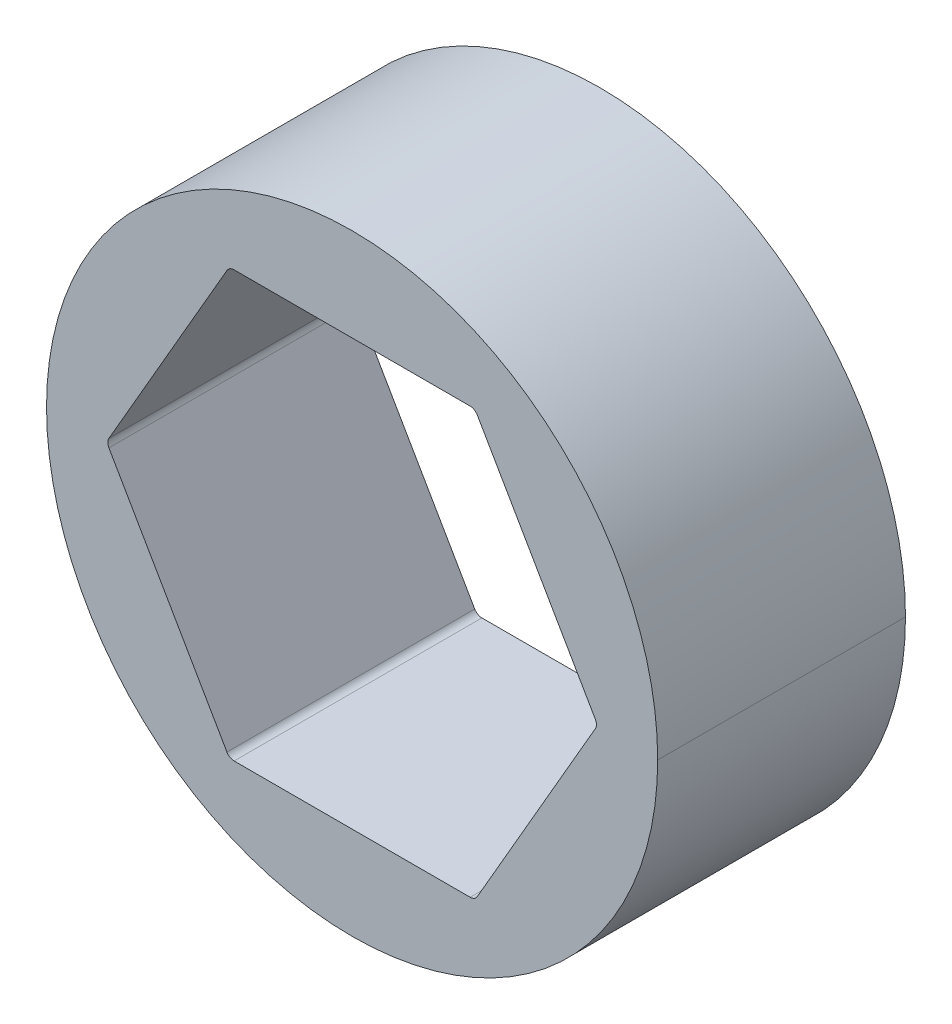
ISO-10303-21;
HEADER;
FILE_DESCRIPTION(('STEP AP214'),'2;1');
FILE_NAME('part.step','',(''),(''),'','','');
FILE_SCHEMA(('AUTOMOTIVE_DESIGN { 1 0 10303 214 1 1 1 1 }'));
ENDSEC;
DATA;
#1=APPLICATION_CONTEXT('core data for automotive mechanical design processes');
#2=APPLICATION_PROTOCOL_DEFINITION('international standard','automotive_design',2000,#1);
#3=PRODUCT_CONTEXT('',#1,'mechanical');
#4=PRODUCT('Part','Part','',(#3));
#5=PRODUCT_RELATED_PRODUCT_CATEGORY('part','',(#4));
#6=PRODUCT_DEFINITION_FORMATION('','',#4);
#7=PRODUCT_DEFINITION_CONTEXT('part definition',#1,'design');
#8=PRODUCT_DEFINITION('design','',#6,#7);
#9=PRODUCT_DEFINITION_SHAPE('','',#8);
#10=(LENGTH_UNIT() NAMED_UNIT(*) SI_UNIT(.MILLI.,.METRE.));
#11=(NAMED_UNIT(*) PLANE_ANGLE_UNIT() SI_UNIT($,.RADIAN.));
#12=(NAMED_UNIT(*) SI_UNIT($,.STERADIAN.) SOLID_ANGLE_UNIT());
#13=UNCERTAINTY_MEASURE_WITH_UNIT(LENGTH_MEASURE(1.E-05),#10,'distance_accuracy_value','');
#14=(GEOMETRIC_REPRESENTATION_CONTEXT(3) GLOBAL_UNCERTAINTY_ASSIGNED_CONTEXT((#13)) GLOBAL_UNIT_ASSIGNED_CONTEXT((#10,
#11,#12)) REPRESENTATION_CONTEXT('',''));
#15=CARTESIAN_POINT('',(0.,0.,0.));
#16=DIRECTION('',(0.,0.,1.));
#17=DIRECTION('',(1.,0.,0.));
#18=AXIS2_PLACEMENT_3D('',#15,#16,#17);
#19=CARTESIAN_POINT('',(7.25902493452117,0.,30.48));
#20=DIRECTION('',(0.,0.,1.));
#21=DIRECTION('',(1.,0.,0.));
#22=AXIS2_PLACEMENT_3D('',#19,#20,#21);
#23=CYLINDRICAL_SURFACE('',#22,0.254);
#24=CARTESIAN_POINT('',(7.25902493452117,0.,7.62));
#25=DIRECTION('',(0.,0.,1.));
#26=DIRECTION('',(1.,0.,0.));
#27=AXIS2_PLACEMENT_3D('',#24,#25,#26);
#28=CIRCLE('',#27,0.254);
#29=CARTESIAN_POINT('',(7.47899538708242,0.127,7.62));
#30=VERTEX_POINT('',#29);
#31=CARTESIAN_POINT('',(7.51302493452117,0.,7.62));
#32=VERTEX_POINT('',#31);
#33=EDGE_CURVE('E305',#30,#32,#28,.F.);
#34=ORIENTED_EDGE('',*,*,#33,.F.);
#35=DIRECTION('',(0.,0.,1.));
#36=VECTOR('',#35,1.);
#37=CARTESIAN_POINT('',(7.47899538708242,0.127,30.48));
#38=LINE('',#37,#36);
#39=CARTESIAN_POINT('',(7.47899538708242,0.127,0.));
#40=VERTEX_POINT('',#39);
#41=EDGE_CURVE('E271',#40,#30,#38,.T.);
#42=ORIENTED_EDGE('',*,*,#41,.F.);
#43=CARTESIAN_POINT('',(7.25902493452117,0.,0.));
#44=DIRECTION('',(0.,0.,1.));
#45=DIRECTION('',(1.,0.,0.));
#46=AXIS2_PLACEMENT_3D('',#43,#44,#45);
#47=CIRCLE('',#46,0.254);
#48=CARTESIAN_POINT('',(7.51302493452117,0.,0.));
#49=VERTEX_POINT('',#48);
#50=EDGE_CURVE('E203',#49,#40,#47,.T.);
#51=ORIENTED_EDGE('',*,*,#50,.F.);
#52=DIRECTION('',(0.,0.,1.));
#53=VECTOR('',#52,1.);
#54=CARTESIAN_POINT('',(7.51302493452117,0.,30.48));
#55=LINE('',#54,#53);
#56=EDGE_CURVE('E56',#49,#32,#55,.T.);
#57=ORIENTED_EDGE('',*,*,#56,.T.);
#58=EDGE_LOOP('',(#34,#42,#51,#57));
#59=FACE_BOUND('',#58,.T.);
#60=ADVANCED_FACE('F47',(#59),#23,.F.);
#61=CARTESIAN_POINT('',(0.,0.,30.48));
#62=DIRECTION('',(0.,0.,-1.));
#63=DIRECTION('',(-1.,0.,0.));
#64=AXIS2_PLACEMENT_3D('',#61,#62,#63);
#65=CYLINDRICAL_SURFACE('',#64,9.398);
#66=DIRECTION('',(0.,0.,-1.));
#67=VECTOR('',#66,1.);
#68=CARTESIAN_POINT('',(-9.398,0.,30.48));
#69=LINE('',#68,#67);
#70=CARTESIAN_POINT('',(-9.398,0.,7.62));
#71=VERTEX_POINT('',#70);
#72=CARTESIAN_POINT('',(-9.398,0.,0.));
#73=VERTEX_POINT('',#72);
#74=EDGE_CURVE('E178',#71,#73,#69,.T.);
#75=ORIENTED_EDGE('',*,*,#74,.F.);
#76=CARTESIAN_POINT('',(0.,0.,7.62));
#77=DIRECTION('',(0.,0.,1.));
#78=DIRECTION('',(1.,0.,0.));
#79=AXIS2_PLACEMENT_3D('',#76,#77,#78);
#80=CIRCLE('',#79,9.398);
#81=CARTESIAN_POINT('',(9.398,0.,7.62));
#82=VERTEX_POINT('',#81);
#83=EDGE_CURVE('E62',#82,#71,#80,.T.);
#84=ORIENTED_EDGE('',*,*,#83,.F.);
#85=DIRECTION('',(0.,0.,-1.));
#86=VECTOR('',#85,1.);
#87=CARTESIAN_POINT('',(9.398,0.,30.48));
#88=LINE('',#87,#86);
#89=CARTESIAN_POINT('',(9.398,0.,0.));
#90=VERTEX_POINT('',#89);
#91=EDGE_CURVE('E176',#82,#90,#88,.T.);
#92=ORIENTED_EDGE('',*,*,#91,.T.);
#93=CARTESIAN_POINT('',(0.,0.,0.));
#94=DIRECTION('',(0.,0.,1.));
#95=DIRECTION('',(1.,0.,0.));
#96=AXIS2_PLACEMENT_3D('',#93,#94,#95);
#97=CIRCLE('',#96,9.398);
#98=EDGE_CURVE('E185',#90,#73,#97,.T.);
#99=ORIENTED_EDGE('',*,*,#98,.T.);
#100=EDGE_LOOP('',(#75,#84,#92,#99));
#101=FACE_BOUND('',#100,.T.);
#102=ADVANCED_FACE('F174',(#101),#65,.T.);
#103=CARTESIAN_POINT('',(0.,0.,30.48));
#104=DIRECTION('',(0.,0.,-1.));
#105=DIRECTION('',(-1.,0.,0.));
#106=AXIS2_PLACEMENT_3D('',#103,#104,#105);
#107=CYLINDRICAL_SURFACE('',#106,9.398);
#108=ORIENTED_EDGE('',*,*,#91,.F.);
#109=EDGE_CURVE('E166',#71,#82,#80,.T.);
#110=ORIENTED_EDGE('',*,*,#109,.F.);
#111=ORIENTED_EDGE('',*,*,#74,.T.);
#112=CARTESIAN_POINT('',(0.,0.,0.));
#113=DIRECTION('',(0.,0.,1.));
#114=DIRECTION('',(1.,0.,0.));
#115=AXIS2_PLACEMENT_3D('',#112,#113,#114);
#116=CIRCLE('',#115,9.398);
#117=EDGE_CURVE('E183',#73,#90,#116,.T.);
#118=ORIENTED_EDGE('',*,*,#117,.T.);
#119=EDGE_LOOP('',(#108,#110,#111,#118));
#120=FACE_BOUND('',#119,.T.);
#121=ADVANCED_FACE('F181',(#120),#107,.T.);
#122=CARTESIAN_POINT('',(3.77615943563475,-6.5405,30.48));
#123=DIRECTION('',(-0.866025403784439,0.5,0.));
#124=DIRECTION('',(0.,0.,1.));
#125=AXIS2_PLACEMENT_3D('',#122,#123,#124);
#126=PLANE('',#125);
#127=DIRECTION('',(0.,0.,1.));
#128=VECTOR('',#127,1.);
#129=CARTESIAN_POINT('',(3.84948291982184,-6.4135,30.48));
#130=LINE('',#129,#128);
#131=CARTESIAN_POINT('',(3.84948291982184,-6.4135,0.));
#132=VERTEX_POINT('',#131);
#133=CARTESIAN_POINT('',(3.84948291982184,-6.4135,7.62));
#134=VERTEX_POINT('',#133);
#135=EDGE_CURVE('E222',#132,#134,#130,.T.);
#136=ORIENTED_EDGE('',*,*,#135,.T.);
#137=DIRECTION('',(0.5,0.866025403784439,0.));
#138=VECTOR('',#137,1.);
#139=CARTESIAN_POINT('',(3.77615943563475,-6.5405,7.62));
#140=LINE('',#139,#138);
#141=CARTESIAN_POINT('',(7.47899538708242,-0.127000000000001,7.62));
#142=VERTEX_POINT('',#141);
#143=EDGE_CURVE('E315',#134,#142,#140,.T.);
#144=ORIENTED_EDGE('',*,*,#143,.T.);
#145=DIRECTION('',(0.,0.,-1.));
#146=VECTOR('',#145,1.);
#147=CARTESIAN_POINT('',(7.47899538708242,-0.127,0.));
#148=LINE('',#147,#146);
#149=CARTESIAN_POINT('',(7.47899538708242,-0.127000000000001,0.));
#150=VERTEX_POINT('',#149);
#151=EDGE_CURVE('E226',#142,#150,#148,.T.);
#152=ORIENTED_EDGE('',*,*,#151,.T.);
#153=DIRECTION('',(0.5,0.866025403784439,0.));
#154=VECTOR('',#153,1.);
#155=CARTESIAN_POINT('',(3.77615943563475,-6.5405,0.));
#156=LINE('',#155,#154);
#157=EDGE_CURVE('E202',#132,#150,#156,.T.);
#158=ORIENTED_EDGE('',*,*,#157,.F.);
#159=EDGE_LOOP('',(#136,#144,#152,#158));
#160=FACE_BOUND('',#159,.T.);
#161=ADVANCED_FACE('F449',(#160),#126,.T.);
#162=CARTESIAN_POINT('',(7.5523188712695,0.,30.48));
#163=DIRECTION('',(-0.866025403784438,-0.5,0.));
#164=DIRECTION('',(-0.5,0.866025403784438,0.));
#165=AXIS2_PLACEMENT_3D('',#162,#163,#164);
#166=PLANE('',#165);
#167=ORIENTED_EDGE('',*,*,#41,.T.);
#168=DIRECTION('',(-0.5,0.866025403784438,0.));
#169=VECTOR('',#168,1.);
#170=CARTESIAN_POINT('',(7.5523188712695,0.,7.62));
#171=LINE('',#170,#169);
#172=CARTESIAN_POINT('',(3.84948291982183,6.4135,7.62));
#173=VERTEX_POINT('',#172);
#174=EDGE_CURVE('E300',#30,#173,#171,.T.);
#175=ORIENTED_EDGE('',*,*,#174,.T.);
#176=DIRECTION('',(0.,0.,-1.));
#177=VECTOR('',#176,1.);
#178=CARTESIAN_POINT('',(3.84948291982183,6.4135,0.));
#179=LINE('',#178,#177);
#180=CARTESIAN_POINT('',(3.84948291982183,6.4135,0.));
#181=VERTEX_POINT('',#180);
#182=EDGE_CURVE('E232',#173,#181,#179,.T.);
#183=ORIENTED_EDGE('',*,*,#182,.T.);
#184=DIRECTION('',(-0.5,0.866025403784438,0.));
#185=VECTOR('',#184,1.);
#186=CARTESIAN_POINT('',(7.5523188712695,0.,0.));
#187=LINE('',#186,#185);
#188=EDGE_CURVE('E230',#40,#181,#187,.T.);
#189=ORIENTED_EDGE('',*,*,#188,.F.);
#190=EDGE_LOOP('',(#167,#175,#183,#189));
#191=FACE_BOUND('',#190,.T.);
#192=ADVANCED_FACE('F299',(#191),#166,.T.);
#193=CARTESIAN_POINT('',(3.77615943563475,6.5405,30.48));
#194=DIRECTION('',(0.,-1.,0.));
#195=DIRECTION('',(0.,0.,-1.));
#196=AXIS2_PLACEMENT_3D('',#193,#194,#195);
#197=PLANE('',#196);
#198=DIRECTION('',(0.,0.,1.));
#199=VECTOR('',#198,1.);
#200=CARTESIAN_POINT('',(3.62951246726058,6.5405,30.48));
#201=LINE('',#200,#199);
#202=CARTESIAN_POINT('',(3.62951246726058,6.5405,0.));
#203=VERTEX_POINT('',#202);
#204=CARTESIAN_POINT('',(3.62951246726058,6.5405,7.62));
#205=VERTEX_POINT('',#204);
#206=EDGE_CURVE('E267',#203,#205,#201,.T.);
#207=ORIENTED_EDGE('',*,*,#206,.T.);
#208=DIRECTION('',(-1.,0.,0.));
#209=VECTOR('',#208,1.);
#210=CARTESIAN_POINT('',(3.77615943563475,6.5405,7.62));
#211=LINE('',#210,#209);
#212=CARTESIAN_POINT('',(-3.62951246726058,6.5405,7.62));
#213=VERTEX_POINT('',#212);
#214=EDGE_CURVE('E327',#205,#213,#211,.T.);
#215=ORIENTED_EDGE('',*,*,#214,.T.);
#216=DIRECTION('',(0.,0.,-1.));
#217=VECTOR('',#216,1.);
#218=CARTESIAN_POINT('',(-3.62951246726058,6.5405,0.));
#219=LINE('',#218,#217);
#220=CARTESIAN_POINT('',(-3.62951246726058,6.5405,0.));
#221=VERTEX_POINT('',#220);
#222=EDGE_CURVE('E272',#213,#221,#219,.T.);
#223=ORIENTED_EDGE('',*,*,#222,.T.);
#224=DIRECTION('',(-1.,0.,0.));
#225=VECTOR('',#224,1.);
#226=CARTESIAN_POINT('',(3.77615943563475,6.5405,0.));
#227=LINE('',#226,#225);
#228=EDGE_CURVE('E255',#203,#221,#227,.T.);
#229=ORIENTED_EDGE('',*,*,#228,.F.);
#230=EDGE_LOOP('',(#207,#215,#223,#229));
#231=FACE_BOUND('',#230,.T.);
#232=ADVANCED_FACE('F463',(#231),#197,.T.);
#233=CARTESIAN_POINT('',(-3.77615943563474,6.5405,30.48));
#234=DIRECTION('',(0.866025403784439,-0.5,0.));
#235=DIRECTION('',(0.,0.,-1.));
#236=AXIS2_PLACEMENT_3D('',#233,#234,#235);
#237=PLANE('',#236);
#238=DIRECTION('',(0.,0.,1.));
#239=VECTOR('',#238,1.);
#240=CARTESIAN_POINT('',(-3.84948291982183,6.4135,30.48));
#241=LINE('',#240,#239);
#242=CARTESIAN_POINT('',(-3.84948291982183,6.4135,0.));
#243=VERTEX_POINT('',#242);
#244=CARTESIAN_POINT('',(-3.84948291982183,6.4135,7.62));
#245=VERTEX_POINT('',#244);
#246=EDGE_CURVE('E196',#243,#245,#241,.T.);
#247=ORIENTED_EDGE('',*,*,#246,.T.);
#248=DIRECTION('',(-0.5,-0.866025403784439,0.));
#249=VECTOR('',#248,1.);
#250=CARTESIAN_POINT('',(-3.77615943563474,6.5405,7.62));
#251=LINE('',#250,#249);
#252=CARTESIAN_POINT('',(-7.47899538708242,0.127000000000006,7.62));
#253=VERTEX_POINT('',#252);
#254=EDGE_CURVE('E341',#245,#253,#251,.T.);
#255=ORIENTED_EDGE('',*,*,#254,.T.);
#256=DIRECTION('',(0.,0.,-1.));
#257=VECTOR('',#256,1.);
#258=CARTESIAN_POINT('',(-7.47899538708241,0.127000000000002,0.));
#259=LINE('',#258,#257);
#260=CARTESIAN_POINT('',(-7.47899538708241,0.127000000000003,0.));
#261=VERTEX_POINT('',#260);
#262=EDGE_CURVE('E245',#253,#261,#259,.T.);
#263=ORIENTED_EDGE('',*,*,#262,.T.);
#264=DIRECTION('',(-0.5,-0.866025403784439,0.));
#265=VECTOR('',#264,1.);
#266=CARTESIAN_POINT('',(-3.77615943563474,6.5405,0.));
#267=LINE('',#266,#265);
#268=EDGE_CURVE('E256',#243,#261,#267,.T.);
#269=ORIENTED_EDGE('',*,*,#268,.F.);
#270=EDGE_LOOP('',(#247,#255,#263,#269));
#271=FACE_BOUND('',#270,.T.);
#272=ADVANCED_FACE('F362',(#271),#237,.T.);
#273=CARTESIAN_POINT('',(-7.5523188712695,0.,30.48));
#274=DIRECTION('',(0.866025403784439,0.5,0.));
#275=DIRECTION('',(0.,0.,-1.));
#276=AXIS2_PLACEMENT_3D('',#273,#274,#275);
#277=PLANE('',#276);
#278=DIRECTION('',(0.,0.,1.));
#279=VECTOR('',#278,1.);
#280=CARTESIAN_POINT('',(-7.47899538708241,-0.126999999999998,30.48));
#281=LINE('',#280,#279);
#282=CARTESIAN_POINT('',(-7.47899538708241,-0.126999999999999,0.));
#283=VERTEX_POINT('',#282);
#284=CARTESIAN_POINT('',(-7.47899538708241,-0.126999999999998,7.62));
#285=VERTEX_POINT('',#284);
#286=EDGE_CURVE('E209',#283,#285,#281,.T.);
#287=ORIENTED_EDGE('',*,*,#286,.T.);
#288=DIRECTION('',(0.5,-0.866025403784439,0.));
#289=VECTOR('',#288,1.);
#290=CARTESIAN_POINT('',(-7.5523188712695,0.,7.62));
#291=LINE('',#290,#289);
#292=CARTESIAN_POINT('',(-3.84948291982184,-6.4135,7.62));
#293=VERTEX_POINT('',#292);
#294=EDGE_CURVE('E69',#285,#293,#291,.T.);
#295=ORIENTED_EDGE('',*,*,#294,.T.);
#296=DIRECTION('',(0.,0.,-1.));
#297=VECTOR('',#296,1.);
#298=CARTESIAN_POINT('',(-3.84948291982183,-6.4135,0.));
#299=LINE('',#298,#297);
#300=CARTESIAN_POINT('',(-3.84948291982183,-6.4135,0.));
#301=VERTEX_POINT('',#300);
#302=EDGE_CURVE('E213',#293,#301,#299,.T.);
#303=ORIENTED_EDGE('',*,*,#302,.T.);
#304=DIRECTION('',(0.5,-0.866025403784439,0.));
#305=VECTOR('',#304,1.);
#306=CARTESIAN_POINT('',(-7.5523188712695,0.,0.));
#307=LINE('',#306,#305);
#308=EDGE_CURVE('E221',#283,#301,#307,.T.);
#309=ORIENTED_EDGE('',*,*,#308,.F.);
#310=EDGE_LOOP('',(#287,#295,#303,#309));
#311=FACE_BOUND('',#310,.T.);
#312=ADVANCED_FACE('F348',(#311),#277,.T.);
#313=CARTESIAN_POINT('',(-3.77615943563474,-6.5405,30.48));
#314=DIRECTION('',(0.,1.,0.));
#315=DIRECTION('',(1.,0.,0.));
#316=AXIS2_PLACEMENT_3D('',#313,#314,#315);
#317=PLANE('',#316);
#318=DIRECTION('',(0.,0.,1.));
#319=VECTOR('',#318,1.);
#320=CARTESIAN_POINT('',(-3.62951246726058,-6.5405,30.48));
#321=LINE('',#320,#319);
#322=CARTESIAN_POINT('',(-3.62951246726058,-6.5405,0.));
#323=VERTEX_POINT('',#322);
#324=CARTESIAN_POINT('',(-3.62951246726058,-6.5405,7.62));
#325=VERTEX_POINT('',#324);
#326=EDGE_CURVE('E207',#323,#325,#321,.T.);
#327=ORIENTED_EDGE('',*,*,#326,.T.);
#328=DIRECTION('',(1.,0.,0.));
#329=VECTOR('',#328,1.);
#330=CARTESIAN_POINT('',(-3.77615943563474,-6.5405,7.62));
#331=LINE('',#330,#329);
#332=CARTESIAN_POINT('',(3.62951246726059,-6.5405,7.62));
#333=VERTEX_POINT('',#332);
#334=EDGE_CURVE('E331',#325,#333,#331,.T.);
#335=ORIENTED_EDGE('',*,*,#334,.T.);
#336=DIRECTION('',(0.,0.,-1.));
#337=VECTOR('',#336,1.);
#338=CARTESIAN_POINT('',(3.62951246726059,-6.5405,0.));
#339=LINE('',#338,#337);
#340=CARTESIAN_POINT('',(3.62951246726058,-6.5405,0.));
#341=VERTEX_POINT('',#340);
#342=EDGE_CURVE('E204',#333,#341,#339,.T.);
#343=ORIENTED_EDGE('',*,*,#342,.T.);
#344=DIRECTION('',(1.,0.,0.));
#345=VECTOR('',#344,1.);
#346=CARTESIAN_POINT('',(-3.77615943563474,-6.5405,0.));
#347=LINE('',#346,#345);
#348=EDGE_CURVE('E192',#323,#341,#347,.T.);
#349=ORIENTED_EDGE('',*,*,#348,.F.);
#350=EDGE_LOOP('',(#327,#335,#343,#349));
#351=FACE_BOUND('',#350,.T.);
#352=ADVANCED_FACE('F483',(#351),#317,.T.);
#353=CARTESIAN_POINT('',(3.62951246726058,6.2865,30.48));
#354=DIRECTION('',(0.,0.,1.));
#355=DIRECTION('',(1.,0.,0.));
#356=AXIS2_PLACEMENT_3D('',#353,#354,#355);
#357=CYLINDRICAL_SURFACE('',#356,0.254);
#358=CARTESIAN_POINT('',(3.62951246726058,6.2865,7.62));
#359=DIRECTION('',(0.,0.,1.));
#360=DIRECTION('',(1.,0.,0.));
#361=AXIS2_PLACEMENT_3D('',#358,#359,#360);
#362=CIRCLE('',#361,0.254);
#363=EDGE_CURVE('E321',#205,#173,#362,.F.);
#364=ORIENTED_EDGE('',*,*,#363,.F.);
#365=ORIENTED_EDGE('',*,*,#206,.F.);
#366=CARTESIAN_POINT('',(3.62951246726058,6.2865,0.));
#367=DIRECTION('',(0.,0.,1.));
#368=DIRECTION('',(1.,0.,0.));
#369=AXIS2_PLACEMENT_3D('',#366,#367,#368);
#370=CIRCLE('',#369,0.254);
#371=EDGE_CURVE('E260',#181,#203,#370,.T.);
#372=ORIENTED_EDGE('',*,*,#371,.F.);
#373=ORIENTED_EDGE('',*,*,#182,.F.);
#374=EDGE_LOOP('',(#364,#365,#372,#373));
#375=FACE_BOUND('',#374,.T.);
#376=ADVANCED_FACE('F490',(#375),#357,.F.);
#377=CARTESIAN_POINT('',(-3.62951246726058,6.2865,30.48));
#378=DIRECTION('',(0.,0.,1.));
#379=DIRECTION('',(1.,0.,0.));
#380=AXIS2_PLACEMENT_3D('',#377,#378,#379);
#381=CYLINDRICAL_SURFACE('',#380,0.254);
#382=CARTESIAN_POINT('',(-3.62951246726058,6.2865,7.62));
#383=DIRECTION('',(0.,0.,1.));
#384=DIRECTION('',(1.,0.,0.));
#385=AXIS2_PLACEMENT_3D('',#382,#383,#384);
#386=CIRCLE('',#385,0.254);
#387=EDGE_CURVE('E335',#245,#213,#386,.F.);
#388=ORIENTED_EDGE('',*,*,#387,.F.);
#389=ORIENTED_EDGE('',*,*,#246,.F.);
#390=CARTESIAN_POINT('',(-3.62951246726058,6.2865,0.));
#391=DIRECTION('',(0.,0.,1.));
#392=DIRECTION('',(1.,0.,0.));
#393=AXIS2_PLACEMENT_3D('',#390,#391,#392);
#394=CIRCLE('',#393,0.254);
#395=EDGE_CURVE('E251',#221,#243,#394,.T.);
#396=ORIENTED_EDGE('',*,*,#395,.F.);
#397=ORIENTED_EDGE('',*,*,#222,.F.);
#398=EDGE_LOOP('',(#388,#389,#396,#397));
#399=FACE_BOUND('',#398,.T.);
#400=ADVANCED_FACE('F498',(#399),#381,.F.);
#401=CARTESIAN_POINT('',(-3.62951246726058,-6.2865,30.48));
#402=DIRECTION('',(0.,0.,1.));
#403=DIRECTION('',(1.,0.,0.));
#404=AXIS2_PLACEMENT_3D('',#401,#402,#403);
#405=CYLINDRICAL_SURFACE('',#404,0.254);
#406=CARTESIAN_POINT('',(-3.62951246726058,-6.2865,7.62));
#407=DIRECTION('',(0.,0.,1.));
#408=DIRECTION('',(1.,0.,0.));
#409=AXIS2_PLACEMENT_3D('',#406,#407,#408);
#410=CIRCLE('',#409,0.254);
#411=EDGE_CURVE('E338',#325,#293,#410,.F.);
#412=ORIENTED_EDGE('',*,*,#411,.F.);
#413=ORIENTED_EDGE('',*,*,#326,.F.);
#414=CARTESIAN_POINT('',(-3.62951246726058,-6.2865,0.));
#415=DIRECTION('',(0.,0.,1.));
#416=DIRECTION('',(1.,0.,0.));
#417=AXIS2_PLACEMENT_3D('',#414,#415,#416);
#418=CIRCLE('',#417,0.254);
#419=EDGE_CURVE('E218',#301,#323,#418,.T.);
#420=ORIENTED_EDGE('',*,*,#419,.F.);
#421=ORIENTED_EDGE('',*,*,#302,.F.);
#422=EDGE_LOOP('',(#412,#413,#420,#421));
#423=FACE_BOUND('',#422,.T.);
#424=ADVANCED_FACE('F353',(#423),#405,.F.);
#425=CARTESIAN_POINT('',(3.62951246726059,-6.2865,30.48));
#426=DIRECTION('',(0.,0.,1.));
#427=DIRECTION('',(1.,0.,0.));
#428=AXIS2_PLACEMENT_3D('',#425,#426,#427);
#429=CYLINDRICAL_SURFACE('',#428,0.254);
#430=CARTESIAN_POINT('',(3.62951246726059,-6.2865,7.62));
#431=DIRECTION('',(0.,0.,1.));
#432=DIRECTION('',(1.,0.,0.));
#433=AXIS2_PLACEMENT_3D('',#430,#431,#432);
#434=CIRCLE('',#433,0.254);
#435=EDGE_CURVE('E324',#134,#333,#434,.F.);
#436=ORIENTED_EDGE('',*,*,#435,.F.);
#437=ORIENTED_EDGE('',*,*,#135,.F.);
#438=CARTESIAN_POINT('',(3.62951246726059,-6.2865,0.));
#439=DIRECTION('',(0.,0.,1.));
#440=DIRECTION('',(1.,0.,0.));
#441=AXIS2_PLACEMENT_3D('',#438,#439,#440);
#442=CIRCLE('',#441,0.254);
#443=EDGE_CURVE('E214',#341,#132,#442,.T.);
#444=ORIENTED_EDGE('',*,*,#443,.F.);
#445=ORIENTED_EDGE('',*,*,#342,.F.);
#446=EDGE_LOOP('',(#436,#437,#444,#445));
#447=FACE_BOUND('',#446,.T.);
#448=ADVANCED_FACE('F396',(#447),#429,.F.);
#449=CARTESIAN_POINT('',(7.25902493452117,0.,30.48));
#450=DIRECTION('',(0.,0.,1.));
#451=DIRECTION('',(1.,0.,0.));
#452=AXIS2_PLACEMENT_3D('',#449,#450,#451);
#453=CYLINDRICAL_SURFACE('',#452,0.254);
#454=CARTESIAN_POINT('',(7.25902493452117,0.,7.62));
#455=DIRECTION('',(0.,0.,1.));
#456=DIRECTION('',(1.,0.,0.));
#457=AXIS2_PLACEMENT_3D('',#454,#455,#456);
#458=CIRCLE('',#457,0.254);
#459=EDGE_CURVE('E208',#32,#142,#458,.F.);
#460=ORIENTED_EDGE('',*,*,#459,.F.);
#461=ORIENTED_EDGE('',*,*,#56,.F.);
#462=CARTESIAN_POINT('',(7.25902493452117,0.,0.));
#463=DIRECTION('',(0.,0.,1.));
#464=DIRECTION('',(1.,0.,0.));
#465=AXIS2_PLACEMENT_3D('',#462,#463,#464);
#466=CIRCLE('',#465,0.254);
#467=EDGE_CURVE('E198',#150,#49,#466,.T.);
#468=ORIENTED_EDGE('',*,*,#467,.F.);
#469=ORIENTED_EDGE('',*,*,#151,.F.);
#470=EDGE_LOOP('',(#460,#461,#468,#469));
#471=FACE_BOUND('',#470,.T.);
#472=ADVANCED_FACE('F311',(#471),#453,.F.);
#473=CARTESIAN_POINT('',(-7.25902493452117,0.,30.48));
#474=DIRECTION('',(0.,0.,1.));
#475=DIRECTION('',(1.,0.,0.));
#476=AXIS2_PLACEMENT_3D('',#473,#474,#475);
#477=CYLINDRICAL_SURFACE('',#476,0.254);
#478=CARTESIAN_POINT('',(-7.25902493452117,0.,7.62));
#479=DIRECTION('',(0.,0.,1.));
#480=DIRECTION('',(1.,0.,0.));
#481=AXIS2_PLACEMENT_3D('',#478,#479,#480);
#482=CIRCLE('',#481,0.254);
#483=EDGE_CURVE('E11',#285,#253,#482,.F.);
#484=ORIENTED_EDGE('',*,*,#483,.F.);
#485=ORIENTED_EDGE('',*,*,#286,.F.);
#486=CARTESIAN_POINT('',(-7.25902493452117,0.,0.));
#487=DIRECTION('',(0.,0.,1.));
#488=DIRECTION('',(1.,0.,0.));
#489=AXIS2_PLACEMENT_3D('',#486,#487,#488);
#490=CIRCLE('',#489,0.254);
#491=EDGE_CURVE('E242',#261,#283,#490,.T.);
#492=ORIENTED_EDGE('',*,*,#491,.F.);
#493=ORIENTED_EDGE('',*,*,#262,.F.);
#494=EDGE_LOOP('',(#484,#485,#492,#493));
#495=FACE_BOUND('',#494,.T.);
#496=ADVANCED_FACE('F49',(#495),#477,.F.);
#497=CARTESIAN_POINT('',(0.,0.,0.));
#498=DIRECTION('',(0.,0.,1.));
#499=DIRECTION('',(1.,0.,0.));
#500=AXIS2_PLACEMENT_3D('',#497,#498,#499);
#501=PLANE('',#500);
#502=ORIENTED_EDGE('',*,*,#117,.F.);
#503=ORIENTED_EDGE('',*,*,#98,.F.);
#504=EDGE_LOOP('',(#502,#503));
#505=FACE_BOUND('',#504,.T.);
#506=ORIENTED_EDGE('',*,*,#348,.T.);
#507=ORIENTED_EDGE('',*,*,#443,.T.);
#508=ORIENTED_EDGE('',*,*,#157,.T.);
#509=ORIENTED_EDGE('',*,*,#467,.T.);
#510=ORIENTED_EDGE('',*,*,#50,.T.);
#511=ORIENTED_EDGE('',*,*,#188,.T.);
#512=ORIENTED_EDGE('',*,*,#371,.T.);
#513=ORIENTED_EDGE('',*,*,#228,.T.);
#514=ORIENTED_EDGE('',*,*,#395,.T.);
#515=ORIENTED_EDGE('',*,*,#268,.T.);
#516=ORIENTED_EDGE('',*,*,#491,.T.);
#517=ORIENTED_EDGE('',*,*,#308,.T.);
#518=ORIENTED_EDGE('',*,*,#419,.T.);
#519=EDGE_LOOP('',(#506,#507,#508,#509,#510,#511,#512,#513,#514,#515,#516,#517,#518));
#520=FACE_BOUND('',#519,.T.);
#521=ADVANCED_FACE('F306',(#505,#520),#501,.F.);
#522=CARTESIAN_POINT('',(0.,0.,7.62));
#523=DIRECTION('',(0.,0.,1.));
#524=DIRECTION('',(1.,0.,0.));
#525=AXIS2_PLACEMENT_3D('',#522,#523,#524);
#526=PLANE('',#525);
#527=ORIENTED_EDGE('',*,*,#83,.T.);
#528=ORIENTED_EDGE('',*,*,#109,.T.);
#529=EDGE_LOOP('',(#527,#528));
#530=FACE_BOUND('',#529,.T.);
#531=ORIENTED_EDGE('',*,*,#459,.T.);
#532=ORIENTED_EDGE('',*,*,#143,.F.);
#533=ORIENTED_EDGE('',*,*,#435,.T.);
#534=ORIENTED_EDGE('',*,*,#334,.F.);
#535=ORIENTED_EDGE('',*,*,#411,.T.);
#536=ORIENTED_EDGE('',*,*,#294,.F.);
#537=ORIENTED_EDGE('',*,*,#483,.T.);
#538=ORIENTED_EDGE('',*,*,#254,.F.);
#539=ORIENTED_EDGE('',*,*,#387,.T.);
#540=ORIENTED_EDGE('',*,*,#214,.F.);
#541=ORIENTED_EDGE('',*,*,#363,.T.);
#542=ORIENTED_EDGE('',*,*,#174,.F.);
#543=ORIENTED_EDGE('',*,*,#33,.T.);
#544=EDGE_LOOP('',(#531,#532,#533,#534,#535,#536,#537,#538,#539,#540,#541,#542,#543));
#545=FACE_BOUND('',#544,.T.);
#546=ADVANCED_FACE('F167',(#530,#545),#526,.T.);
#547=CLOSED_SHELL('',(#60,#102,#121,#161,#192,#232,#272,#312,#352,#376,#400,#424,#448,#472,#496,
#521,#546));
#548=MANIFOLD_SOLID_BREP('B2',#547);
#549=ADVANCED_BREP_SHAPE_REPRESENTATION('',(#18,#548),#14);
#550=SHAPE_DEFINITION_REPRESENTATION(#9,#549);
ENDSEC;
END-ISO-10303-21;
